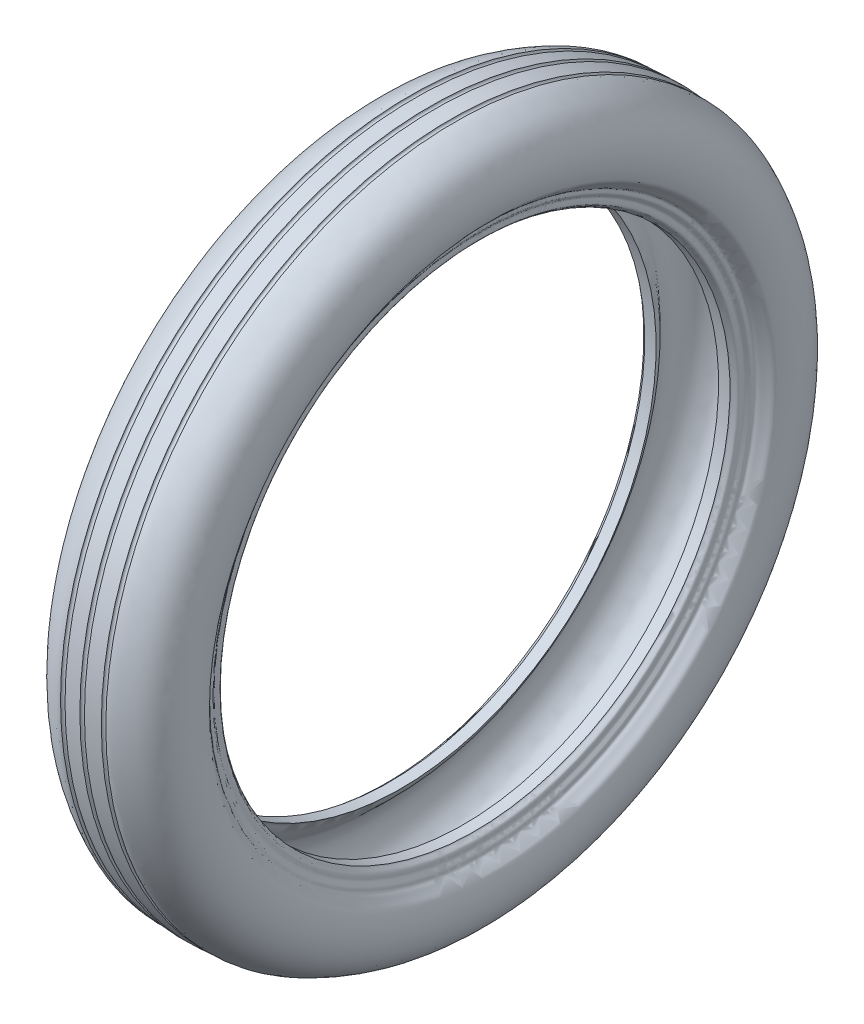
ISO-10303-21;
HEADER;
FILE_DESCRIPTION(('STEP AP214'),'2;1');
FILE_NAME('part.step','',(''),(''),'','','');
FILE_SCHEMA(('AUTOMOTIVE_DESIGN { 1 0 10303 214 1 1 1 1 }'));
ENDSEC;
DATA;
#1=APPLICATION_CONTEXT('core data for automotive mechanical design processes');
#2=APPLICATION_PROTOCOL_DEFINITION('international standard','automotive_design',2000,#1);
#3=PRODUCT_CONTEXT('',#1,'mechanical');
#4=PRODUCT('Part','Part','',(#3));
#5=PRODUCT_RELATED_PRODUCT_CATEGORY('part','',(#4));
#6=PRODUCT_DEFINITION_FORMATION('','',#4);
#7=PRODUCT_DEFINITION_CONTEXT('part definition',#1,'design');
#8=PRODUCT_DEFINITION('design','',#6,#7);
#9=PRODUCT_DEFINITION_SHAPE('','',#8);
#10=(LENGTH_UNIT() NAMED_UNIT(*) SI_UNIT(.MILLI.,.METRE.));
#11=(NAMED_UNIT(*) PLANE_ANGLE_UNIT() SI_UNIT($,.RADIAN.));
#12=(NAMED_UNIT(*) SI_UNIT($,.STERADIAN.) SOLID_ANGLE_UNIT());
#13=UNCERTAINTY_MEASURE_WITH_UNIT(LENGTH_MEASURE(1.E-05),#10,'distance_accuracy_value','');
#14=(GEOMETRIC_REPRESENTATION_CONTEXT(3) GLOBAL_UNCERTAINTY_ASSIGNED_CONTEXT((#13)) GLOBAL_UNIT_ASSIGNED_CONTEXT((#10,
#11,#12)) REPRESENTATION_CONTEXT('',''));
#15=CARTESIAN_POINT('',(0.,0.,0.));
#16=DIRECTION('',(0.,0.,1.));
#17=DIRECTION('',(1.,0.,0.));
#18=AXIS2_PLACEMENT_3D('',#15,#16,#17);
#19=CARTESIAN_POINT('',(-24.8172630139917,203.,0.));
#20=CARTESIAN_POINT('',(-27.2283998288289,205.06391431928,0.));
#21=CARTESIAN_POINT('',(-28.5496427344952,210.327625908058,0.));
#22=CARTESIAN_POINT('',(-33.6712545353592,215.019378984169,0.));
#23=CARTESIAN_POINT('',(-37.7772976660351,219.010363555149,0.));
#24=CARTESIAN_POINT('',(-42.2633577257313,223.062020269606,0.));
#25=CARTESIAN_POINT('',(-45.1671204187017,229.55393791157,0.));
#26=CARTESIAN_POINT('',(-48.0286654197166,236.65779205585,0.));
#27=CARTESIAN_POINT('',(-47.8879674715827,244.882513096217,0.));
#28=CARTESIAN_POINT('',(-46.3948773163548,254.057111445877,0.));
#29=CARTESIAN_POINT('',(-40.3486929351291,261.403587543646,0.));
#30=CARTESIAN_POINT('',(-33.851481321555,268.81086706887,0.));
#31=CARTESIAN_POINT('',(-25.2444175261157,271.404992130535,0.));
#32=CARTESIAN_POINT('',(-16.7423312191855,273.18641912113,0.));
#33=CARTESIAN_POINT('',(-10.1405547550226,273.463220362378,0.));
#34=CARTESIAN_POINT('',(-4.54429512443643,274.014061695448,0.));
#35=CARTESIAN_POINT('',(-1.75340207589833,273.445280920895,0.));
#36=CARTESIAN_POINT('',(0.,273.651830628835,0.));
#37=B_SPLINE_CURVE_WITH_KNOTS('',3,(#19,#20,#21,#22,#23,#24,#25,#26,#27,#28,#29,#30,#31,#32,#33,
#34,#35,#36),.UNSPECIFIED.,.F.,.F.,(4,1,1,1,1,1,1,1,1,1,1,1,1,1,1,4),(0.,0.0822330624444425,
0.137617146698626,0.183009302880853,0.237253629031035,0.297469874379483,0.371716047539101,
0.44060468979368,0.515818013596818,0.616103802574389,0.690267434104086,0.776013817716258,
0.849380324821276,0.924772592656254,0.952990480004338,1.),.UNSPECIFIED.);
#38=CARTESIAN_POINT('',(-102.722911074857,0.,0.));
#39=DIRECTION('',(-1.,0.,0.));
#40=AXIS1_PLACEMENT('',#38,#39);
#41=SURFACE_OF_REVOLUTION('',#37,#40);
#42=CARTESIAN_POINT('',(0.,0.,0.));
#43=DIRECTION('',(-1.,0.,0.));
#44=DIRECTION('',(0.,0.,1.));
#45=AXIS2_PLACEMENT_3D('',#42,#43,#44);
#46=CIRCLE('',#45,273.651830628835);
#47=CARTESIAN_POINT('',(0.,0.,273.651830628835));
#48=VERTEX_POINT('',#47);
#49=EDGE_CURVE('E10',#48,#48,#46,.T.);
#50=ORIENTED_EDGE('',*,*,#49,.F.);
#51=EDGE_LOOP('',(#50));
#52=FACE_BOUND('',#51,.T.);
#53=CARTESIAN_POINT('',(-24.8172630139917,0.,0.));
#54=DIRECTION('',(-1.,0.,0.));
#55=DIRECTION('',(0.,0.,1.));
#56=AXIS2_PLACEMENT_3D('',#53,#54,#55);
#57=CIRCLE('',#56,203.);
#58=CARTESIAN_POINT('',(-24.8172630139917,0.,203.));
#59=VERTEX_POINT('',#58);
#60=EDGE_CURVE('E70',#59,#59,#57,.T.);
#61=ORIENTED_EDGE('',*,*,#60,.T.);
#62=EDGE_LOOP('',(#61));
#63=FACE_BOUND('',#62,.T.);
#64=ADVANCED_FACE('F32',(#52,#63),#41,.T.);
#65=CARTESIAN_POINT('',(0.,273.651830628835,0.));
#66=CARTESIAN_POINT('',(1.7534020758983,273.445280920895,0.));
#67=CARTESIAN_POINT('',(4.5442951244364,274.014061695448,0.));
#68=CARTESIAN_POINT('',(10.1405547550225,273.463220362378,0.));
#69=CARTESIAN_POINT('',(16.7423312191854,273.186419121129,0.));
#70=CARTESIAN_POINT('',(25.2444175261157,271.404992130535,0.));
#71=CARTESIAN_POINT('',(33.851481321555,268.81086706887,0.));
#72=CARTESIAN_POINT('',(40.3486929351291,261.403587543646,0.));
#73=CARTESIAN_POINT('',(46.3948773163547,254.057111445877,0.));
#74=CARTESIAN_POINT('',(47.8879674715826,244.882513096217,0.));
#75=CARTESIAN_POINT('',(48.0286654197166,236.65779205585,0.));
#76=CARTESIAN_POINT('',(45.1671204187017,229.55393791157,0.));
#77=CARTESIAN_POINT('',(42.2633577257312,223.062020269606,0.));
#78=CARTESIAN_POINT('',(37.7772976660351,219.010363555149,0.));
#79=CARTESIAN_POINT('',(33.6712545353592,215.019378984169,0.));
#80=CARTESIAN_POINT('',(28.5496427344952,210.327625908058,0.));
#81=CARTESIAN_POINT('',(27.2283998288289,205.06391431928,0.));
#82=CARTESIAN_POINT('',(24.8172630139916,203.,0.));
#83=B_SPLINE_CURVE_WITH_KNOTS('',3,(#65,#66,#67,#68,#69,#70,#71,#72,#73,#74,#75,#76,#77,#78,#79,
#80,#81,#82),.UNSPECIFIED.,.F.,.F.,(4,1,1,1,1,1,1,1,1,1,1,1,1,1,1,4),(0.,0.0470095199956621,
0.0752274073437459,0.150619675178724,0.223986182283742,0.309732565895914,0.383896197425612,
0.484181986403182,0.55939531020632,0.628283952460899,0.702530125620518,0.762746370968965,
0.816990697119147,0.862382853301374,0.917766937555557,1.),.UNSPECIFIED.);
#84=CARTESIAN_POINT('',(-102.722911074857,0.,0.));
#85=DIRECTION('',(-1.,0.,0.));
#86=AXIS1_PLACEMENT('',#84,#85);
#87=SURFACE_OF_REVOLUTION('',#83,#86);
#88=CARTESIAN_POINT('',(24.8172630139917,0.,0.));
#89=DIRECTION('',(-1.,0.,0.));
#90=DIRECTION('',(0.,0.,1.));
#91=AXIS2_PLACEMENT_3D('',#88,#89,#90);
#92=CIRCLE('',#91,203.);
#93=CARTESIAN_POINT('',(24.8172630139917,0.,203.));
#94=VERTEX_POINT('',#93);
#95=EDGE_CURVE('E39',#94,#94,#92,.T.);
#96=ORIENTED_EDGE('',*,*,#95,.F.);
#97=EDGE_LOOP('',(#96));
#98=FACE_BOUND('',#97,.T.);
#99=ORIENTED_EDGE('',*,*,#49,.T.);
#100=EDGE_LOOP('',(#99));
#101=FACE_BOUND('',#100,.T.);
#102=ADVANCED_FACE('F117',(#98,#101),#87,.T.);
#103=CARTESIAN_POINT('',(-102.722911074857,0.,0.));
#104=DIRECTION('',(-1.,0.,0.));
#105=DIRECTION('',(0.,0.,1.));
#106=AXIS2_PLACEMENT_3D('',#103,#104,#105);
#107=CYLINDRICAL_SURFACE('',#106,203.);
#108=CARTESIAN_POINT('',(33.9052748219322,0.,0.));
#109=DIRECTION('',(-1.,0.,0.));
#110=DIRECTION('',(0.,0.,1.));
#111=AXIS2_PLACEMENT_3D('',#108,#109,#110);
#112=CIRCLE('',#111,203.);
#113=CARTESIAN_POINT('',(33.9052748219322,0.,203.));
#114=VERTEX_POINT('',#113);
#115=EDGE_CURVE('E43',#114,#114,#112,.T.);
#116=ORIENTED_EDGE('',*,*,#115,.F.);
#117=EDGE_LOOP('',(#116));
#118=FACE_BOUND('',#117,.T.);
#119=ORIENTED_EDGE('',*,*,#95,.T.);
#120=EDGE_LOOP('',(#119));
#121=FACE_BOUND('',#120,.T.);
#122=ADVANCED_FACE('F114',(#118,#121),#107,.F.);
#123=CARTESIAN_POINT('',(33.9052748219323,203.,0.));
#124=CARTESIAN_POINT('',(34.4514477122976,204.223315441255,0.));
#125=CARTESIAN_POINT('',(38.405176851135,205.210772848352,0.));
#126=CARTESIAN_POINT('',(37.5895196663085,208.702454770499,0.));
#127=CARTESIAN_POINT('',(37.3176730115443,211.637363166268,0.));
#128=CARTESIAN_POINT('',(40.3679293440638,213.465220786409,0.));
#129=CARTESIAN_POINT('',(39.0660676586276,217.086806756293,0.));
#130=CARTESIAN_POINT('',(42.5299588621192,218.987124675277,0.));
#131=CARTESIAN_POINT('',(44.4812031460707,222.024976144124,0.));
#132=CARTESIAN_POINT('',(48.1613248996428,224.664233070907,0.));
#133=CARTESIAN_POINT('',(49.3373100798012,231.297261903147,0.));
#134=CARTESIAN_POINT('',(50.5659703704679,239.217588361253,0.));
#135=CARTESIAN_POINT('',(49.5419089182548,249.309832870114,0.));
#136=CARTESIAN_POINT('',(46.4257794125868,258.785832909676,0.));
#137=CARTESIAN_POINT('',(40.6849116029119,266.454028141102,0.));
#138=CARTESIAN_POINT('',(33.8688282793654,271.544671240841,0.));
#139=CARTESIAN_POINT('',(26.5848661668035,275.239525498986,0.));
#140=CARTESIAN_POINT('',(21.3849500525043,277.770418692312,0.));
#141=CARTESIAN_POINT('',(18.0012541580362,277.496758701426,0.));
#142=B_SPLINE_CURVE_WITH_KNOTS('',3,(#123,#124,#125,#126,#127,#128,#129,#130,#131,#132,#133,
#134,#135,#136,#137,#138,#139,#140,#141),.UNSPECIFIED.,.F.,.F.,(4,1,1,1,1,1,1,1,1,1,1,1,1,1,1,1,
4),(0.,0.0502849018641816,0.0809639249454713,0.0972057606943899,0.139297033110355,
0.164562110942005,0.195188010133947,0.242420179219544,0.280702553209471,0.328072425704126,
0.440671496514186,0.53314982377352,0.638161135079807,0.746440040072595,0.823682365401741,
0.89958494243369,1.),.UNSPECIFIED.);
#143=CARTESIAN_POINT('',(-102.722911074857,0.,0.));
#144=DIRECTION('',(-1.,0.,0.));
#145=AXIS1_PLACEMENT('',#143,#144);
#146=SURFACE_OF_REVOLUTION('',#142,#145);
#147=CARTESIAN_POINT('',(18.0012541580362,0.,0.));
#148=DIRECTION('',(-1.,0.,0.));
#149=DIRECTION('',(0.,0.,1.));
#150=AXIS2_PLACEMENT_3D('',#147,#148,#149);
#151=CIRCLE('',#150,277.496758701426);
#152=CARTESIAN_POINT('',(18.0012541580362,0.,277.496758701426));
#153=VERTEX_POINT('',#152);
#154=EDGE_CURVE('E47',#153,#153,#151,.T.);
#155=ORIENTED_EDGE('',*,*,#154,.F.);
#156=EDGE_LOOP('',(#155));
#157=FACE_BOUND('',#156,.T.);
#158=ORIENTED_EDGE('',*,*,#115,.T.);
#159=EDGE_LOOP('',(#158));
#160=FACE_BOUND('',#159,.T.);
#161=ADVANCED_FACE('F110',(#157,#160),#146,.T.);
#162=CARTESIAN_POINT('',(16.2157456896604,0.,0.));
#163=DIRECTION('',(-1.,0.,0.));
#164=DIRECTION('',(0.,0.,1.));
#165=AXIS2_PLACEMENT_3D('',#162,#163,#164);
#166=TOROIDAL_SURFACE('',#165,277.496758701426,1.7855084683758);
#167=CARTESIAN_POINT('',(14.4302372212846,0.,0.));
#168=DIRECTION('',(-1.,0.,0.));
#169=DIRECTION('',(0.,0.,1.));
#170=AXIS2_PLACEMENT_3D('',#167,#168,#169);
#171=CIRCLE('',#170,277.496758701426);
#172=CARTESIAN_POINT('',(14.4302372212846,0.,277.496758701426));
#173=VERTEX_POINT('',#172);
#174=EDGE_CURVE('E52',#173,#173,#171,.T.);
#175=ORIENTED_EDGE('',*,*,#174,.F.);
#176=EDGE_LOOP('',(#175));
#177=FACE_BOUND('',#176,.T.);
#178=ORIENTED_EDGE('',*,*,#154,.T.);
#179=EDGE_LOOP('',(#178));
#180=FACE_BOUND('',#179,.T.);
#181=ADVANCED_FACE('F106',(#177,#180),#166,.F.);
#182=CARTESIAN_POINT('',(14.4302372212846,0.,0.));
#183=DIRECTION('',(-1.,0.,0.));
#184=DIRECTION('',(0.,0.,1.));
#185=AXIS2_PLACEMENT_3D('',#182,#183,#184);
#186=CONICAL_SURFACE('',#185,277.496758701426,0.0638636091062138);
#187=CARTESIAN_POINT('',(1.81905865515339,0.,0.));
#188=DIRECTION('',(-1.,0.,0.));
#189=DIRECTION('',(0.,0.,1.));
#190=AXIS2_PLACEMENT_3D('',#187,#188,#189);
#191=CIRCLE('',#190,278.303250820303);
#192=CARTESIAN_POINT('',(1.81905865515339,0.,278.303250820303));
#193=VERTEX_POINT('',#192);
#194=EDGE_CURVE('E55',#193,#193,#191,.T.);
#195=ORIENTED_EDGE('',*,*,#194,.F.);
#196=EDGE_LOOP('',(#195));
#197=FACE_BOUND('',#196,.T.);
#198=ORIENTED_EDGE('',*,*,#174,.T.);
#199=EDGE_LOOP('',(#198));
#200=FACE_BOUND('',#199,.T.);
#201=ADVANCED_FACE('F102',(#197,#200),#186,.T.);
#202=CARTESIAN_POINT('',(0.,0.,0.));
#203=DIRECTION('',(-1.,0.,0.));
#204=DIRECTION('',(0.,0.,1.));
#205=AXIS2_PLACEMENT_3D('',#202,#203,#204);
#206=TOROIDAL_SURFACE('',#205,278.303250820303,1.8190586551534);
#207=CARTESIAN_POINT('',(-1.81905865515342,0.,0.));
#208=DIRECTION('',(-1.,0.,0.));
#209=DIRECTION('',(0.,0.,1.));
#210=AXIS2_PLACEMENT_3D('',#207,#208,#209);
#211=CIRCLE('',#210,278.303250820303);
#212=CARTESIAN_POINT('',(-1.81905865515342,0.,278.303250820303));
#213=VERTEX_POINT('',#212);
#214=EDGE_CURVE('E58',#213,#213,#211,.T.);
#215=ORIENTED_EDGE('',*,*,#214,.F.);
#216=EDGE_LOOP('',(#215));
#217=FACE_BOUND('',#216,.T.);
#218=ORIENTED_EDGE('',*,*,#194,.T.);
#219=EDGE_LOOP('',(#218));
#220=FACE_BOUND('',#219,.T.);
#221=ADVANCED_FACE('F98',(#217,#220),#206,.F.);
#222=CARTESIAN_POINT('',(-1.81905865515342,0.,0.));
#223=DIRECTION('',(1.,0.,0.));
#224=DIRECTION('',(0.,0.,-1.));
#225=AXIS2_PLACEMENT_3D('',#222,#223,#224);
#226=CONICAL_SURFACE('',#225,278.303250820303,0.0638636091062136);
#227=CARTESIAN_POINT('',(-14.4302372212846,0.,0.));
#228=DIRECTION('',(-1.,0.,0.));
#229=DIRECTION('',(0.,0.,1.));
#230=AXIS2_PLACEMENT_3D('',#227,#228,#229);
#231=CIRCLE('',#230,277.496758701426);
#232=CARTESIAN_POINT('',(-14.4302372212846,0.,277.496758701426));
#233=VERTEX_POINT('',#232);
#234=EDGE_CURVE('E61',#233,#233,#231,.T.);
#235=ORIENTED_EDGE('',*,*,#234,.F.);
#236=EDGE_LOOP('',(#235));
#237=FACE_BOUND('',#236,.T.);
#238=ORIENTED_EDGE('',*,*,#214,.T.);
#239=EDGE_LOOP('',(#238));
#240=FACE_BOUND('',#239,.T.);
#241=ADVANCED_FACE('F94',(#237,#240),#226,.T.);
#242=CARTESIAN_POINT('',(-16.2157456896604,0.,0.));
#243=DIRECTION('',(-1.,0.,0.));
#244=DIRECTION('',(0.,0.,1.));
#245=AXIS2_PLACEMENT_3D('',#242,#243,#244);
#246=TOROIDAL_SURFACE('',#245,277.496758701426,1.78550846837579);
#247=CARTESIAN_POINT('',(-18.0012541580362,0.,0.));
#248=DIRECTION('',(-1.,0.,0.));
#249=DIRECTION('',(0.,0.,1.));
#250=AXIS2_PLACEMENT_3D('',#247,#248,#249);
#251=CIRCLE('',#250,277.496758701426);
#252=CARTESIAN_POINT('',(-18.0012541580362,0.,277.496758701426));
#253=VERTEX_POINT('',#252);
#254=EDGE_CURVE('E64',#253,#253,#251,.T.);
#255=ORIENTED_EDGE('',*,*,#254,.F.);
#256=EDGE_LOOP('',(#255));
#257=FACE_BOUND('',#256,.T.);
#258=ORIENTED_EDGE('',*,*,#234,.T.);
#259=EDGE_LOOP('',(#258));
#260=FACE_BOUND('',#259,.T.);
#261=ADVANCED_FACE('F90',(#257,#260),#246,.F.);
#262=CARTESIAN_POINT('',(-18.0012541580362,277.496758701426,0.));
#263=CARTESIAN_POINT('',(-21.3849500525043,277.770418692312,0.));
#264=CARTESIAN_POINT('',(-26.5848661668036,275.239525498986,0.));
#265=CARTESIAN_POINT('',(-33.8688282793654,271.544671240841,0.));
#266=CARTESIAN_POINT('',(-40.6849116029119,266.454028141102,0.));
#267=CARTESIAN_POINT('',(-46.4257794125868,258.785832909676,0.));
#268=CARTESIAN_POINT('',(-49.5419089182548,249.309832870114,0.));
#269=CARTESIAN_POINT('',(-50.5659703704679,239.217588361253,0.));
#270=CARTESIAN_POINT('',(-49.3373100798012,231.297261903147,0.));
#271=CARTESIAN_POINT('',(-48.1613248996428,224.664233070907,0.));
#272=CARTESIAN_POINT('',(-44.4812031460707,222.024976144124,0.));
#273=CARTESIAN_POINT('',(-42.5299588621193,218.987124675277,0.));
#274=CARTESIAN_POINT('',(-39.0660676586276,217.086806756293,0.));
#275=CARTESIAN_POINT('',(-40.3679293440638,213.465220786409,0.));
#276=CARTESIAN_POINT('',(-37.3176730115443,211.637363166268,0.));
#277=CARTESIAN_POINT('',(-37.5895196663085,208.702454770499,0.));
#278=CARTESIAN_POINT('',(-38.405176851135,205.210772848352,0.));
#279=CARTESIAN_POINT('',(-34.4514477122976,204.223315441255,0.));
#280=CARTESIAN_POINT('',(-33.9052748219323,203.,0.));
#281=B_SPLINE_CURVE_WITH_KNOTS('',3,(#262,#263,#264,#265,#266,#267,#268,#269,#270,#271,#272,
#273,#274,#275,#276,#277,#278,#279,#280),.UNSPECIFIED.,.F.,.F.,(4,1,1,1,1,1,1,1,1,1,1,1,1,1,1,1,
4),(0.,0.10041505756631,0.176317634598259,0.253559959927405,0.361838864920193,0.46685017622648,
0.559328503485814,0.671927574295874,0.719297446790528,0.757579820780456,0.804811989866053,
0.835437889057995,0.860702966889645,0.90279423930561,0.919036075054529,0.949715098135818,1.),.UNSPECIFIED.);
#282=CARTESIAN_POINT('',(-102.722911074857,0.,0.));
#283=DIRECTION('',(-1.,0.,0.));
#284=AXIS1_PLACEMENT('',#282,#283);
#285=SURFACE_OF_REVOLUTION('',#281,#284);
#286=CARTESIAN_POINT('',(-33.9052748219323,0.,0.));
#287=DIRECTION('',(-1.,0.,0.));
#288=DIRECTION('',(0.,0.,1.));
#289=AXIS2_PLACEMENT_3D('',#286,#287,#288);
#290=CIRCLE('',#289,203.);
#291=CARTESIAN_POINT('',(-33.9052748219323,0.,203.));
#292=VERTEX_POINT('',#291);
#293=EDGE_CURVE('E67',#292,#292,#290,.T.);
#294=ORIENTED_EDGE('',*,*,#293,.F.);
#295=EDGE_LOOP('',(#294));
#296=FACE_BOUND('',#295,.T.);
#297=ORIENTED_EDGE('',*,*,#254,.T.);
#298=EDGE_LOOP('',(#297));
#299=FACE_BOUND('',#298,.T.);
#300=ADVANCED_FACE('F85',(#296,#299),#285,.T.);
#301=CARTESIAN_POINT('',(-102.722911074857,0.,0.));
#302=DIRECTION('',(-1.,0.,0.));
#303=DIRECTION('',(0.,0.,1.));
#304=AXIS2_PLACEMENT_3D('',#301,#302,#303);
#305=CYLINDRICAL_SURFACE('',#304,203.);
#306=ORIENTED_EDGE('',*,*,#60,.F.);
#307=EDGE_LOOP('',(#306));
#308=FACE_BOUND('',#307,.T.);
#309=ORIENTED_EDGE('',*,*,#293,.T.);
#310=EDGE_LOOP('',(#309));
#311=FACE_BOUND('',#310,.T.);
#312=ADVANCED_FACE('F89',(#308,#311),#305,.F.);
#313=CLOSED_SHELL('',(#64,#102,#122,#161,#181,#201,#221,#241,#261,#300,#312));
#314=MANIFOLD_SOLID_BREP('B2',#313);
#315=ADVANCED_BREP_SHAPE_REPRESENTATION('',(#18,#314),#14);
#316=SHAPE_DEFINITION_REPRESENTATION(#9,#315);
ENDSEC;
END-ISO-10303-21;
